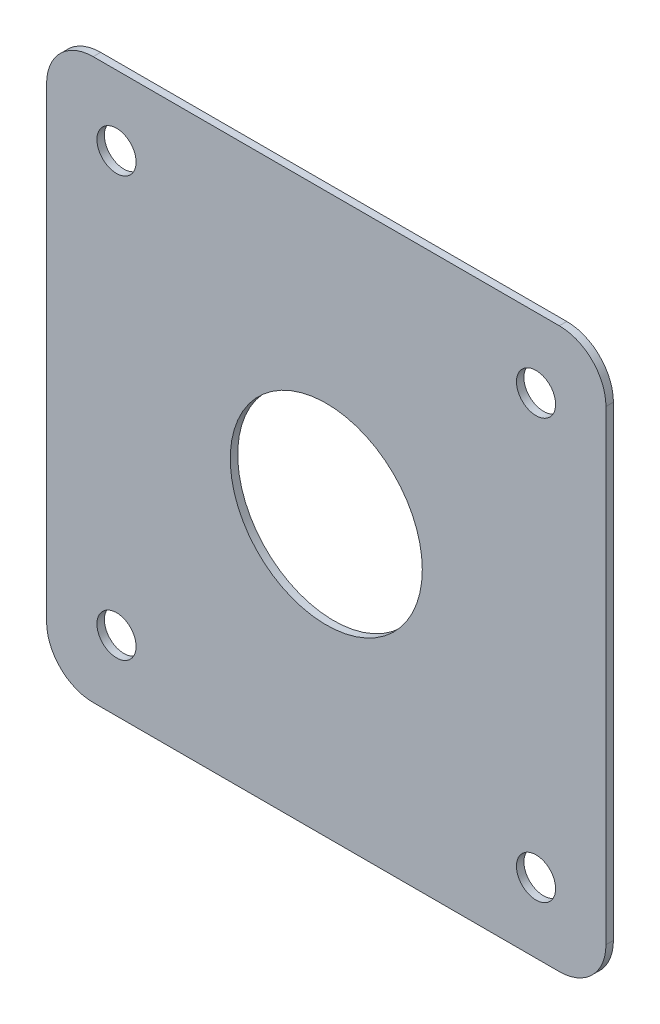
ISO-10303-21;
HEADER;
FILE_DESCRIPTION(('STEP AP214'),'2;1');
FILE_NAME('part.step','',(''),(''),'','','');
FILE_SCHEMA(('AUTOMOTIVE_DESIGN { 1 0 10303 214 1 1 1 1 }'));
ENDSEC;
DATA;
#1=APPLICATION_CONTEXT('core data for automotive mechanical design processes');
#2=APPLICATION_PROTOCOL_DEFINITION('international standard','automotive_design',2000,#1);
#3=PRODUCT_CONTEXT('',#1,'mechanical');
#4=PRODUCT('Part','Part','',(#3));
#5=PRODUCT_RELATED_PRODUCT_CATEGORY('part','',(#4));
#6=PRODUCT_DEFINITION_FORMATION('','',#4);
#7=PRODUCT_DEFINITION_CONTEXT('part definition',#1,'design');
#8=PRODUCT_DEFINITION('design','',#6,#7);
#9=PRODUCT_DEFINITION_SHAPE('','',#8);
#10=(LENGTH_UNIT() NAMED_UNIT(*) SI_UNIT(.MILLI.,.METRE.));
#11=(NAMED_UNIT(*) PLANE_ANGLE_UNIT() SI_UNIT($,.RADIAN.));
#12=(NAMED_UNIT(*) SI_UNIT($,.STERADIAN.) SOLID_ANGLE_UNIT());
#13=UNCERTAINTY_MEASURE_WITH_UNIT(LENGTH_MEASURE(1.E-05),#10,'distance_accuracy_value','');
#14=(GEOMETRIC_REPRESENTATION_CONTEXT(3) GLOBAL_UNCERTAINTY_ASSIGNED_CONTEXT((#13)) GLOBAL_UNIT_ASSIGNED_CONTEXT((#10,
#11,#12)) REPRESENTATION_CONTEXT('',''));
#15=CARTESIAN_POINT('',(0.,0.,0.));
#16=DIRECTION('',(0.,0.,1.));
#17=DIRECTION('',(1.,0.,0.));
#18=AXIS2_PLACEMENT_3D('',#15,#16,#17);
#19=CARTESIAN_POINT('',(-30.,30.,-0.8));
#20=DIRECTION('',(-1.,0.,0.));
#21=DIRECTION('',(0.,-1.,0.));
#22=AXIS2_PLACEMENT_3D('',#19,#20,#21);
#23=PLANE('',#22);
#24=DIRECTION('',(0.,-1.,0.));
#25=VECTOR('',#24,1.);
#26=CARTESIAN_POINT('',(-30.,30.,0.));
#27=LINE('',#26,#25);
#28=CARTESIAN_POINT('',(-30.,25.,0.));
#29=VERTEX_POINT('',#28);
#30=CARTESIAN_POINT('',(-30.,-25.,0.));
#31=VERTEX_POINT('',#30);
#32=EDGE_CURVE('E161',#29,#31,#27,.T.);
#33=ORIENTED_EDGE('',*,*,#32,.F.);
#34=DIRECTION('',(0.,0.,1.));
#35=VECTOR('',#34,1.);
#36=CARTESIAN_POINT('',(-30.,25.,-0.8));
#37=LINE('',#36,#35);
#38=CARTESIAN_POINT('',(-30.,25.,-0.8));
#39=VERTEX_POINT('',#38);
#40=EDGE_CURVE('E141',#29,#39,#37,.F.);
#41=ORIENTED_EDGE('',*,*,#40,.T.);
#42=DIRECTION('',(0.,-1.,0.));
#43=VECTOR('',#42,1.);
#44=CARTESIAN_POINT('',(-30.,30.,-0.8));
#45=LINE('',#44,#43);
#46=CARTESIAN_POINT('',(-30.,-25.,-0.8));
#47=VERTEX_POINT('',#46);
#48=EDGE_CURVE('E122',#39,#47,#45,.T.);
#49=ORIENTED_EDGE('',*,*,#48,.T.);
#50=DIRECTION('',(0.,0.,1.));
#51=VECTOR('',#50,1.);
#52=CARTESIAN_POINT('',(-30.,-25.,-0.8));
#53=LINE('',#52,#51);
#54=EDGE_CURVE('E138',#47,#31,#53,.T.);
#55=ORIENTED_EDGE('',*,*,#54,.T.);
#56=EDGE_LOOP('',(#33,#41,#49,#55));
#57=FACE_BOUND('',#56,.T.);
#58=ADVANCED_FACE('F36',(#57),#23,.T.);
#59=CARTESIAN_POINT('',(30.,30.,-0.8));
#60=DIRECTION('',(0.,1.,0.));
#61=DIRECTION('',(-1.,0.,0.));
#62=AXIS2_PLACEMENT_3D('',#59,#60,#61);
#63=PLANE('',#62);
#64=DIRECTION('',(-1.,0.,0.));
#65=VECTOR('',#64,1.);
#66=CARTESIAN_POINT('',(30.,30.,-0.8));
#67=LINE('',#66,#65);
#68=CARTESIAN_POINT('',(25.,30.,-0.8));
#69=VERTEX_POINT('',#68);
#70=CARTESIAN_POINT('',(-25.,30.,-0.8));
#71=VERTEX_POINT('',#70);
#72=EDGE_CURVE('E126',#69,#71,#67,.T.);
#73=ORIENTED_EDGE('',*,*,#72,.T.);
#74=DIRECTION('',(0.,0.,1.));
#75=VECTOR('',#74,1.);
#76=CARTESIAN_POINT('',(-25.,30.,-0.8));
#77=LINE('',#76,#75);
#78=CARTESIAN_POINT('',(-25.,30.,0.));
#79=VERTEX_POINT('',#78);
#80=EDGE_CURVE('E113',#71,#79,#77,.T.);
#81=ORIENTED_EDGE('',*,*,#80,.T.);
#82=DIRECTION('',(-1.,0.,0.));
#83=VECTOR('',#82,1.);
#84=CARTESIAN_POINT('',(30.,30.,0.));
#85=LINE('',#84,#83);
#86=CARTESIAN_POINT('',(25.,30.,0.));
#87=VERTEX_POINT('',#86);
#88=EDGE_CURVE('E105',#87,#79,#85,.T.);
#89=ORIENTED_EDGE('',*,*,#88,.F.);
#90=DIRECTION('',(0.,0.,1.));
#91=VECTOR('',#90,1.);
#92=CARTESIAN_POINT('',(25.,30.,-0.8));
#93=LINE('',#92,#91);
#94=EDGE_CURVE('E119',#87,#69,#93,.F.);
#95=ORIENTED_EDGE('',*,*,#94,.T.);
#96=EDGE_LOOP('',(#73,#81,#89,#95));
#97=FACE_BOUND('',#96,.T.);
#98=ADVANCED_FACE('F118',(#97),#63,.T.);
#99=CARTESIAN_POINT('',(30.,30.,-0.8));
#100=DIRECTION('',(1.,0.,0.));
#101=DIRECTION('',(0.,1.,0.));
#102=AXIS2_PLACEMENT_3D('',#99,#100,#101);
#103=PLANE('',#102);
#104=DIRECTION('',(0.,1.,0.));
#105=VECTOR('',#104,1.);
#106=CARTESIAN_POINT('',(30.,30.,0.));
#107=LINE('',#106,#105);
#108=CARTESIAN_POINT('',(30.,-25.,0.));
#109=VERTEX_POINT('',#108);
#110=CARTESIAN_POINT('',(30.,25.,0.));
#111=VERTEX_POINT('',#110);
#112=EDGE_CURVE('E107',#109,#111,#107,.T.);
#113=ORIENTED_EDGE('',*,*,#112,.F.);
#114=DIRECTION('',(0.,0.,1.));
#115=VECTOR('',#114,1.);
#116=CARTESIAN_POINT('',(30.,-25.,-0.8));
#117=LINE('',#116,#115);
#118=CARTESIAN_POINT('',(30.,-25.,-0.8));
#119=VERTEX_POINT('',#118);
#120=EDGE_CURVE('E11',#109,#119,#117,.F.);
#121=ORIENTED_EDGE('',*,*,#120,.T.);
#122=DIRECTION('',(0.,1.,0.));
#123=VECTOR('',#122,1.);
#124=CARTESIAN_POINT('',(30.,30.,-0.8));
#125=LINE('',#124,#123);
#126=CARTESIAN_POINT('',(30.,25.,-0.8));
#127=VERTEX_POINT('',#126);
#128=EDGE_CURVE('E129',#119,#127,#125,.T.);
#129=ORIENTED_EDGE('',*,*,#128,.T.);
#130=DIRECTION('',(0.,0.,1.));
#131=VECTOR('',#130,1.);
#132=CARTESIAN_POINT('',(30.,25.,-0.8));
#133=LINE('',#132,#131);
#134=EDGE_CURVE('E44',#127,#111,#133,.T.);
#135=ORIENTED_EDGE('',*,*,#134,.T.);
#136=EDGE_LOOP('',(#113,#121,#129,#135));
#137=FACE_BOUND('',#136,.T.);
#138=ADVANCED_FACE('F154',(#137),#103,.T.);
#139=CARTESIAN_POINT('',(30.,-30.,-0.8));
#140=DIRECTION('',(0.,-1.,0.));
#141=DIRECTION('',(1.,0.,0.));
#142=AXIS2_PLACEMENT_3D('',#139,#140,#141);
#143=PLANE('',#142);
#144=DIRECTION('',(1.,0.,0.));
#145=VECTOR('',#144,1.);
#146=CARTESIAN_POINT('',(30.,-30.,0.));
#147=LINE('',#146,#145);
#148=CARTESIAN_POINT('',(-25.,-30.,0.));
#149=VERTEX_POINT('',#148);
#150=CARTESIAN_POINT('',(25.,-30.,0.));
#151=VERTEX_POINT('',#150);
#152=EDGE_CURVE('E164',#149,#151,#147,.T.);
#153=ORIENTED_EDGE('',*,*,#152,.F.);
#154=DIRECTION('',(0.,0.,1.));
#155=VECTOR('',#154,1.);
#156=CARTESIAN_POINT('',(-25.,-30.,-0.8));
#157=LINE('',#156,#155);
#158=CARTESIAN_POINT('',(-25.,-30.,-0.8));
#159=VERTEX_POINT('',#158);
#160=EDGE_CURVE('E58',#149,#159,#157,.F.);
#161=ORIENTED_EDGE('',*,*,#160,.T.);
#162=DIRECTION('',(1.,0.,0.));
#163=VECTOR('',#162,1.);
#164=CARTESIAN_POINT('',(30.,-30.,-0.8));
#165=LINE('',#164,#163);
#166=CARTESIAN_POINT('',(25.,-30.,-0.8));
#167=VERTEX_POINT('',#166);
#168=EDGE_CURVE('E156',#159,#167,#165,.T.);
#169=ORIENTED_EDGE('',*,*,#168,.T.);
#170=DIRECTION('',(0.,0.,1.));
#171=VECTOR('',#170,1.);
#172=CARTESIAN_POINT('',(25.,-30.,-0.8));
#173=LINE('',#172,#171);
#174=EDGE_CURVE('E149',#167,#151,#173,.T.);
#175=ORIENTED_EDGE('',*,*,#174,.T.);
#176=EDGE_LOOP('',(#153,#161,#169,#175));
#177=FACE_BOUND('',#176,.T.);
#178=ADVANCED_FACE('F167',(#177),#143,.T.);
#179=CARTESIAN_POINT('',(0.,0.,-0.8));
#180=DIRECTION('',(0.,0.,-1.));
#181=DIRECTION('',(-1.,0.,0.));
#182=AXIS2_PLACEMENT_3D('',#179,#180,#181);
#183=PLANE('',#182);
#184=CARTESIAN_POINT('',(-22.4999999999986,-22.5,-0.8));
#185=DIRECTION('',(0.,0.,1.));
#186=DIRECTION('',(1.,0.,0.));
#187=AXIS2_PLACEMENT_3D('',#184,#185,#186);
#188=CIRCLE('',#187,2.1);
#189=CARTESIAN_POINT('',(-20.3999999999986,-22.5,-0.8));
#190=VERTEX_POINT('',#189);
#191=EDGE_CURVE('E202',#190,#190,#188,.T.);
#192=ORIENTED_EDGE('',*,*,#191,.T.);
#193=EDGE_LOOP('',(#192));
#194=FACE_BOUND('',#193,.T.);
#195=CARTESIAN_POINT('',(22.5000000000014,-22.4999999999986,-0.8));
#196=DIRECTION('',(0.,0.,1.));
#197=DIRECTION('',(1.,0.,0.));
#198=AXIS2_PLACEMENT_3D('',#195,#196,#197);
#199=CIRCLE('',#198,2.1);
#200=CARTESIAN_POINT('',(24.6000000000014,-22.4999999999986,-0.8));
#201=VERTEX_POINT('',#200);
#202=EDGE_CURVE('E196',#201,#201,#199,.T.);
#203=ORIENTED_EDGE('',*,*,#202,.T.);
#204=EDGE_LOOP('',(#203));
#205=FACE_BOUND('',#204,.T.);
#206=CARTESIAN_POINT('',(22.5,22.5000000000014,-0.8));
#207=DIRECTION('',(0.,0.,1.));
#208=DIRECTION('',(1.,0.,0.));
#209=AXIS2_PLACEMENT_3D('',#206,#207,#208);
#210=CIRCLE('',#209,2.1);
#211=CARTESIAN_POINT('',(24.6,22.5000000000014,-0.8));
#212=VERTEX_POINT('',#211);
#213=EDGE_CURVE('E190',#212,#212,#210,.T.);
#214=ORIENTED_EDGE('',*,*,#213,.T.);
#215=EDGE_LOOP('',(#214));
#216=FACE_BOUND('',#215,.T.);
#217=CARTESIAN_POINT('',(-22.5,22.5,-0.8));
#218=DIRECTION('',(0.,0.,1.));
#219=DIRECTION('',(1.,0.,0.));
#220=AXIS2_PLACEMENT_3D('',#217,#218,#219);
#221=CIRCLE('',#220,2.1);
#222=CARTESIAN_POINT('',(-20.4,22.5,-0.8));
#223=VERTEX_POINT('',#222);
#224=EDGE_CURVE('E184',#223,#223,#221,.T.);
#225=ORIENTED_EDGE('',*,*,#224,.T.);
#226=EDGE_LOOP('',(#225));
#227=FACE_BOUND('',#226,.T.);
#228=CARTESIAN_POINT('',(0.,0.,-0.8));
#229=DIRECTION('',(0.,0.,1.));
#230=DIRECTION('',(1.,0.,0.));
#231=AXIS2_PLACEMENT_3D('',#228,#229,#230);
#232=CIRCLE('',#231,10.3);
#233=CARTESIAN_POINT('',(10.3,0.,-0.8));
#234=VERTEX_POINT('',#233);
#235=EDGE_CURVE('E165',#234,#234,#232,.T.);
#236=ORIENTED_EDGE('',*,*,#235,.T.);
#237=EDGE_LOOP('',(#236));
#238=FACE_BOUND('',#237,.T.);
#239=ORIENTED_EDGE('',*,*,#48,.F.);
#240=CARTESIAN_POINT('',(-25.,25.,-0.8));
#241=DIRECTION('',(0.,0.,-1.));
#242=DIRECTION('',(-1.,0.,0.));
#243=AXIS2_PLACEMENT_3D('',#240,#241,#242);
#244=CIRCLE('',#243,5.);
#245=EDGE_CURVE('E147',#39,#71,#244,.T.);
#246=ORIENTED_EDGE('',*,*,#245,.T.);
#247=ORIENTED_EDGE('',*,*,#72,.F.);
#248=CARTESIAN_POINT('',(25.,25.,-0.8));
#249=DIRECTION('',(0.,0.,-1.));
#250=DIRECTION('',(-1.,0.,0.));
#251=AXIS2_PLACEMENT_3D('',#248,#249,#250);
#252=CIRCLE('',#251,5.);
#253=EDGE_CURVE('E125',#69,#127,#252,.T.);
#254=ORIENTED_EDGE('',*,*,#253,.T.);
#255=ORIENTED_EDGE('',*,*,#128,.F.);
#256=CARTESIAN_POINT('',(25.,-25.,-0.8));
#257=DIRECTION('',(0.,0.,-1.));
#258=DIRECTION('',(-1.,0.,0.));
#259=AXIS2_PLACEMENT_3D('',#256,#257,#258);
#260=CIRCLE('',#259,5.);
#261=EDGE_CURVE('E51',#119,#167,#260,.T.);
#262=ORIENTED_EDGE('',*,*,#261,.T.);
#263=ORIENTED_EDGE('',*,*,#168,.F.);
#264=CARTESIAN_POINT('',(-25.,-25.,-0.8));
#265=DIRECTION('',(0.,0.,-1.));
#266=DIRECTION('',(-1.,0.,0.));
#267=AXIS2_PLACEMENT_3D('',#264,#265,#266);
#268=CIRCLE('',#267,5.);
#269=EDGE_CURVE('E145',#159,#47,#268,.T.);
#270=ORIENTED_EDGE('',*,*,#269,.T.);
#271=EDGE_LOOP('',(#239,#246,#247,#254,#255,#262,#263,#270));
#272=FACE_BOUND('',#271,.T.);
#273=ADVANCED_FACE('F175',(#194,#205,#216,#227,#238,#272),#183,.T.);
#274=CARTESIAN_POINT('',(0.,0.,0.));
#275=DIRECTION('',(0.,0.,-1.));
#276=DIRECTION('',(-1.,0.,0.));
#277=AXIS2_PLACEMENT_3D('',#274,#275,#276);
#278=PLANE('',#277);
#279=CARTESIAN_POINT('',(-22.4999999999986,-22.5,0.));
#280=DIRECTION('',(0.,0.,1.));
#281=DIRECTION('',(1.,0.,0.));
#282=AXIS2_PLACEMENT_3D('',#279,#280,#281);
#283=CIRCLE('',#282,2.1);
#284=CARTESIAN_POINT('',(-20.3999999999986,-22.5,0.));
#285=VERTEX_POINT('',#284);
#286=EDGE_CURVE('E205',#285,#285,#283,.T.);
#287=ORIENTED_EDGE('',*,*,#286,.F.);
#288=EDGE_LOOP('',(#287));
#289=FACE_BOUND('',#288,.T.);
#290=CARTESIAN_POINT('',(22.5000000000014,-22.4999999999986,0.));
#291=DIRECTION('',(0.,0.,1.));
#292=DIRECTION('',(1.,0.,0.));
#293=AXIS2_PLACEMENT_3D('',#290,#291,#292);
#294=CIRCLE('',#293,2.1);
#295=CARTESIAN_POINT('',(24.6000000000014,-22.4999999999986,0.));
#296=VERTEX_POINT('',#295);
#297=EDGE_CURVE('E199',#296,#296,#294,.T.);
#298=ORIENTED_EDGE('',*,*,#297,.F.);
#299=EDGE_LOOP('',(#298));
#300=FACE_BOUND('',#299,.T.);
#301=CARTESIAN_POINT('',(22.5,22.5000000000014,0.));
#302=DIRECTION('',(0.,0.,1.));
#303=DIRECTION('',(1.,0.,0.));
#304=AXIS2_PLACEMENT_3D('',#301,#302,#303);
#305=CIRCLE('',#304,2.1);
#306=CARTESIAN_POINT('',(24.6,22.5000000000014,0.));
#307=VERTEX_POINT('',#306);
#308=EDGE_CURVE('E193',#307,#307,#305,.T.);
#309=ORIENTED_EDGE('',*,*,#308,.F.);
#310=EDGE_LOOP('',(#309));
#311=FACE_BOUND('',#310,.T.);
#312=CARTESIAN_POINT('',(-22.5,22.5,0.));
#313=DIRECTION('',(0.,0.,1.));
#314=DIRECTION('',(1.,0.,0.));
#315=AXIS2_PLACEMENT_3D('',#312,#313,#314);
#316=CIRCLE('',#315,2.1);
#317=CARTESIAN_POINT('',(-20.4,22.5,0.));
#318=VERTEX_POINT('',#317);
#319=EDGE_CURVE('E187',#318,#318,#316,.T.);
#320=ORIENTED_EDGE('',*,*,#319,.F.);
#321=EDGE_LOOP('',(#320));
#322=FACE_BOUND('',#321,.T.);
#323=CARTESIAN_POINT('',(0.,0.,0.));
#324=DIRECTION('',(0.,0.,1.));
#325=DIRECTION('',(1.,0.,0.));
#326=AXIS2_PLACEMENT_3D('',#323,#324,#325);
#327=CIRCLE('',#326,10.3);
#328=CARTESIAN_POINT('',(10.3,0.,0.));
#329=VERTEX_POINT('',#328);
#330=EDGE_CURVE('E181',#329,#329,#327,.T.);
#331=ORIENTED_EDGE('',*,*,#330,.F.);
#332=EDGE_LOOP('',(#331));
#333=FACE_BOUND('',#332,.T.);
#334=ORIENTED_EDGE('',*,*,#88,.T.);
#335=CARTESIAN_POINT('',(-25.,25.,0.));
#336=DIRECTION('',(0.,0.,-1.));
#337=DIRECTION('',(-1.,0.,0.));
#338=AXIS2_PLACEMENT_3D('',#335,#336,#337);
#339=CIRCLE('',#338,5.);
#340=EDGE_CURVE('E136',#79,#29,#339,.F.);
#341=ORIENTED_EDGE('',*,*,#340,.T.);
#342=ORIENTED_EDGE('',*,*,#32,.T.);
#343=CARTESIAN_POINT('',(-25.,-25.,0.));
#344=DIRECTION('',(0.,0.,-1.));
#345=DIRECTION('',(-1.,0.,0.));
#346=AXIS2_PLACEMENT_3D('',#343,#344,#345);
#347=CIRCLE('',#346,5.);
#348=EDGE_CURVE('E134',#31,#149,#347,.F.);
#349=ORIENTED_EDGE('',*,*,#348,.T.);
#350=ORIENTED_EDGE('',*,*,#152,.T.);
#351=CARTESIAN_POINT('',(25.,-25.,0.));
#352=DIRECTION('',(0.,0.,-1.));
#353=DIRECTION('',(-1.,0.,0.));
#354=AXIS2_PLACEMENT_3D('',#351,#352,#353);
#355=CIRCLE('',#354,5.);
#356=EDGE_CURVE('E112',#151,#109,#355,.F.);
#357=ORIENTED_EDGE('',*,*,#356,.T.);
#358=ORIENTED_EDGE('',*,*,#112,.T.);
#359=CARTESIAN_POINT('',(25.,25.,0.));
#360=DIRECTION('',(0.,0.,-1.));
#361=DIRECTION('',(-1.,0.,0.));
#362=AXIS2_PLACEMENT_3D('',#359,#360,#361);
#363=CIRCLE('',#362,5.);
#364=EDGE_CURVE('E102',#111,#87,#363,.F.);
#365=ORIENTED_EDGE('',*,*,#364,.T.);
#366=EDGE_LOOP('',(#334,#341,#342,#349,#350,#357,#358,#365));
#367=FACE_BOUND('',#366,.T.);
#368=ADVANCED_FACE('F104',(#289,#300,#311,#322,#333,#367),#278,.F.);
#369=CARTESIAN_POINT('',(0.,0.,-0.8));
#370=DIRECTION('',(0.,0.,1.));
#371=DIRECTION('',(1.,0.,0.));
#372=AXIS2_PLACEMENT_3D('',#369,#370,#371);
#373=CYLINDRICAL_SURFACE('',#372,10.3);
#374=ORIENTED_EDGE('',*,*,#235,.F.);
#375=EDGE_LOOP('',(#374));
#376=FACE_BOUND('',#375,.T.);
#377=ORIENTED_EDGE('',*,*,#330,.T.);
#378=EDGE_LOOP('',(#377));
#379=FACE_BOUND('',#378,.T.);
#380=ADVANCED_FACE('F223',(#376,#379),#373,.F.);
#381=CARTESIAN_POINT('',(-22.5,22.5,-0.8));
#382=DIRECTION('',(0.,0.,1.));
#383=DIRECTION('',(1.,0.,0.));
#384=AXIS2_PLACEMENT_3D('',#381,#382,#383);
#385=CYLINDRICAL_SURFACE('',#384,2.1);
#386=ORIENTED_EDGE('',*,*,#224,.F.);
#387=EDGE_LOOP('',(#386));
#388=FACE_BOUND('',#387,.T.);
#389=ORIENTED_EDGE('',*,*,#319,.T.);
#390=EDGE_LOOP('',(#389));
#391=FACE_BOUND('',#390,.T.);
#392=ADVANCED_FACE('F234',(#388,#391),#385,.F.);
#393=CARTESIAN_POINT('',(22.5,22.5000000000014,-0.8));
#394=DIRECTION('',(0.,0.,1.));
#395=DIRECTION('',(1.,0.,0.));
#396=AXIS2_PLACEMENT_3D('',#393,#394,#395);
#397=CYLINDRICAL_SURFACE('',#396,2.1);
#398=ORIENTED_EDGE('',*,*,#213,.F.);
#399=EDGE_LOOP('',(#398));
#400=FACE_BOUND('',#399,.T.);
#401=ORIENTED_EDGE('',*,*,#308,.T.);
#402=EDGE_LOOP('',(#401));
#403=FACE_BOUND('',#402,.T.);
#404=ADVANCED_FACE('F240',(#400,#403),#397,.F.);
#405=CARTESIAN_POINT('',(22.5000000000014,-22.4999999999986,-0.8));
#406=DIRECTION('',(0.,0.,1.));
#407=DIRECTION('',(1.,0.,0.));
#408=AXIS2_PLACEMENT_3D('',#405,#406,#407);
#409=CYLINDRICAL_SURFACE('',#408,2.1);
#410=ORIENTED_EDGE('',*,*,#202,.F.);
#411=EDGE_LOOP('',(#410));
#412=FACE_BOUND('',#411,.T.);
#413=ORIENTED_EDGE('',*,*,#297,.T.);
#414=EDGE_LOOP('',(#413));
#415=FACE_BOUND('',#414,.T.);
#416=ADVANCED_FACE('F217',(#412,#415),#409,.F.);
#417=CARTESIAN_POINT('',(-22.4999999999986,-22.5,-0.8));
#418=DIRECTION('',(0.,0.,1.));
#419=DIRECTION('',(1.,0.,0.));
#420=AXIS2_PLACEMENT_3D('',#417,#418,#419);
#421=CYLINDRICAL_SURFACE('',#420,2.1);
#422=ORIENTED_EDGE('',*,*,#191,.F.);
#423=EDGE_LOOP('',(#422));
#424=FACE_BOUND('',#423,.T.);
#425=ORIENTED_EDGE('',*,*,#286,.T.);
#426=EDGE_LOOP('',(#425));
#427=FACE_BOUND('',#426,.T.);
#428=ADVANCED_FACE('F213',(#424,#427),#421,.F.);
#429=CARTESIAN_POINT('',(-25.,25.,-0.8));
#430=DIRECTION('',(0.,0.,1.));
#431=DIRECTION('',(1.,0.,0.));
#432=AXIS2_PLACEMENT_3D('',#429,#430,#431);
#433=CYLINDRICAL_SURFACE('',#432,5.);
#434=ORIENTED_EDGE('',*,*,#245,.F.);
#435=ORIENTED_EDGE('',*,*,#40,.F.);
#436=ORIENTED_EDGE('',*,*,#340,.F.);
#437=ORIENTED_EDGE('',*,*,#80,.F.);
#438=EDGE_LOOP('',(#434,#435,#436,#437));
#439=FACE_BOUND('',#438,.T.);
#440=ADVANCED_FACE('F216',(#439),#433,.T.);
#441=CARTESIAN_POINT('',(-25.,-25.,-0.8));
#442=DIRECTION('',(0.,0.,1.));
#443=DIRECTION('',(1.,0.,0.));
#444=AXIS2_PLACEMENT_3D('',#441,#442,#443);
#445=CYLINDRICAL_SURFACE('',#444,5.);
#446=ORIENTED_EDGE('',*,*,#269,.F.);
#447=ORIENTED_EDGE('',*,*,#160,.F.);
#448=ORIENTED_EDGE('',*,*,#348,.F.);
#449=ORIENTED_EDGE('',*,*,#54,.F.);
#450=EDGE_LOOP('',(#446,#447,#448,#449));
#451=FACE_BOUND('',#450,.T.);
#452=ADVANCED_FACE('F171',(#451),#445,.T.);
#453=CARTESIAN_POINT('',(25.,-25.,-0.8));
#454=DIRECTION('',(0.,0.,1.));
#455=DIRECTION('',(1.,0.,0.));
#456=AXIS2_PLACEMENT_3D('',#453,#454,#455);
#457=CYLINDRICAL_SURFACE('',#456,5.);
#458=ORIENTED_EDGE('',*,*,#261,.F.);
#459=ORIENTED_EDGE('',*,*,#120,.F.);
#460=ORIENTED_EDGE('',*,*,#356,.F.);
#461=ORIENTED_EDGE('',*,*,#174,.F.);
#462=EDGE_LOOP('',(#458,#459,#460,#461));
#463=FACE_BOUND('',#462,.T.);
#464=ADVANCED_FACE('F258',(#463),#457,.T.);
#465=CARTESIAN_POINT('',(25.,25.,-0.8));
#466=DIRECTION('',(0.,0.,1.));
#467=DIRECTION('',(1.,0.,0.));
#468=AXIS2_PLACEMENT_3D('',#465,#466,#467);
#469=CYLINDRICAL_SURFACE('',#468,5.);
#470=ORIENTED_EDGE('',*,*,#253,.F.);
#471=ORIENTED_EDGE('',*,*,#94,.F.);
#472=ORIENTED_EDGE('',*,*,#364,.F.);
#473=ORIENTED_EDGE('',*,*,#134,.F.);
#474=EDGE_LOOP('',(#470,#471,#472,#473));
#475=FACE_BOUND('',#474,.T.);
#476=ADVANCED_FACE('F38',(#475),#469,.T.);
#477=CLOSED_SHELL('',(#58,#98,#138,#178,#273,#368,#380,#392,#404,#416,#428,#440,#452,#464,#476));
#478=MANIFOLD_SOLID_BREP('B2',#477);
#479=ADVANCED_BREP_SHAPE_REPRESENTATION('',(#18,#478),#14);
#480=SHAPE_DEFINITION_REPRESENTATION(#9,#479);
ENDSEC;
END-ISO-10303-21;
